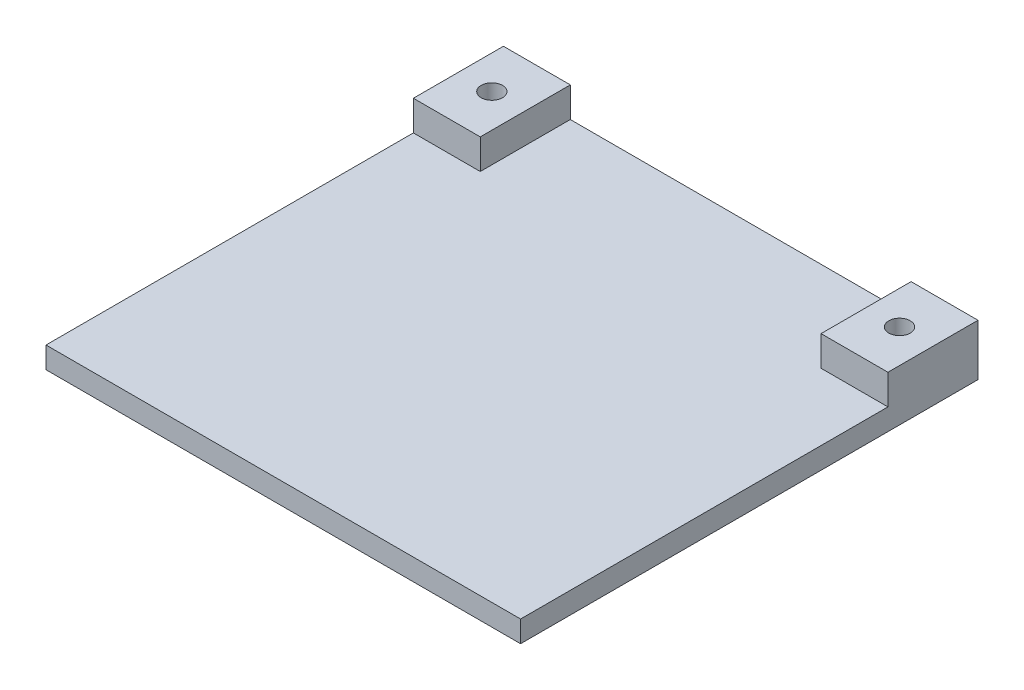
ISO-10303-21;
HEADER;
FILE_DESCRIPTION(('STEP AP214'),'2;1');
FILE_NAME('part.step','',(''),(''),'','','');
FILE_SCHEMA(('AUTOMOTIVE_DESIGN { 1 0 10303 214 1 1 1 1 }'));
ENDSEC;
DATA;
#1=APPLICATION_CONTEXT('core data for automotive mechanical design processes');
#2=APPLICATION_PROTOCOL_DEFINITION('international standard','automotive_design',2000,#1);
#3=PRODUCT_CONTEXT('',#1,'mechanical');
#4=PRODUCT('Part','Part','',(#3));
#5=PRODUCT_RELATED_PRODUCT_CATEGORY('part','',(#4));
#6=PRODUCT_DEFINITION_FORMATION('','',#4);
#7=PRODUCT_DEFINITION_CONTEXT('part definition',#1,'design');
#8=PRODUCT_DEFINITION('design','',#6,#7);
#9=PRODUCT_DEFINITION_SHAPE('','',#8);
#10=(LENGTH_UNIT() NAMED_UNIT(*) SI_UNIT(.MILLI.,.METRE.));
#11=(NAMED_UNIT(*) PLANE_ANGLE_UNIT() SI_UNIT($,.RADIAN.));
#12=(NAMED_UNIT(*) SI_UNIT($,.STERADIAN.) SOLID_ANGLE_UNIT());
#13=UNCERTAINTY_MEASURE_WITH_UNIT(LENGTH_MEASURE(1.E-05),#10,'distance_accuracy_value','');
#14=(GEOMETRIC_REPRESENTATION_CONTEXT(3) GLOBAL_UNCERTAINTY_ASSIGNED_CONTEXT((#13)) GLOBAL_UNIT_ASSIGNED_CONTEXT((#10,
#11,#12)) REPRESENTATION_CONTEXT('',''));
#15=CARTESIAN_POINT('',(0.,0.,0.));
#16=DIRECTION('',(0.,0.,1.));
#17=DIRECTION('',(1.,0.,0.));
#18=AXIS2_PLACEMENT_3D('',#15,#16,#17);
#19=CARTESIAN_POINT('',(0.,1.27,0.));
#20=DIRECTION('',(0.,1.,0.));
#21=DIRECTION('',(0.,0.,1.));
#22=AXIS2_PLACEMENT_3D('',#19,#20,#21);
#23=PLANE('',#22);
#24=DIRECTION('',(1.,0.,0.));
#25=VECTOR('',#24,1.);
#26=CARTESIAN_POINT('',(0.,1.27,-12.319));
#27=LINE('',#26,#25);
#28=CARTESIAN_POINT('',(15.1384,1.27,-12.319));
#29=VERTEX_POINT('',#28);
#30=CARTESIAN_POINT('',(21.082,1.27,-12.319));
#31=VERTEX_POINT('',#30);
#32=EDGE_CURVE('E47',#29,#31,#27,.T.);
#33=ORIENTED_EDGE('',*,*,#32,.F.);
#34=DIRECTION('',(0.,0.,-1.));
#35=VECTOR('',#34,1.);
#36=CARTESIAN_POINT('',(15.1384,1.27,0.));
#37=LINE('',#36,#35);
#38=CARTESIAN_POINT('',(15.1384,1.27,-20.32));
#39=VERTEX_POINT('',#38);
#40=EDGE_CURVE('E11',#29,#39,#37,.T.);
#41=ORIENTED_EDGE('',*,*,#40,.T.);
#42=DIRECTION('',(-1.,0.,0.));
#43=VECTOR('',#42,1.);
#44=CARTESIAN_POINT('',(0.,1.27,-20.32));
#45=LINE('',#44,#43);
#46=CARTESIAN_POINT('',(-15.1384,1.27,-20.32));
#47=VERTEX_POINT('',#46);
#48=EDGE_CURVE('E138',#39,#47,#45,.T.);
#49=ORIENTED_EDGE('',*,*,#48,.T.);
#50=DIRECTION('',(0.,0.,-1.));
#51=VECTOR('',#50,1.);
#52=CARTESIAN_POINT('',(-15.1384,1.27,0.));
#53=LINE('',#52,#51);
#54=CARTESIAN_POINT('',(-15.1384,1.27,-12.319));
#55=VERTEX_POINT('',#54);
#56=EDGE_CURVE('E198',#55,#47,#53,.T.);
#57=ORIENTED_EDGE('',*,*,#56,.F.);
#58=DIRECTION('',(-1.,0.,0.));
#59=VECTOR('',#58,1.);
#60=CARTESIAN_POINT('',(0.,1.27,-12.319));
#61=LINE('',#60,#59);
#62=CARTESIAN_POINT('',(-21.082,1.27,-12.319));
#63=VERTEX_POINT('',#62);
#64=EDGE_CURVE('E189',#55,#63,#61,.T.);
#65=ORIENTED_EDGE('',*,*,#64,.T.);
#66=DIRECTION('',(0.,0.,1.));
#67=VECTOR('',#66,1.);
#68=CARTESIAN_POINT('',(-21.082,1.27,0.));
#69=LINE('',#68,#67);
#70=CARTESIAN_POINT('',(-21.082,1.27,20.32));
#71=VERTEX_POINT('',#70);
#72=EDGE_CURVE('E163',#63,#71,#69,.T.);
#73=ORIENTED_EDGE('',*,*,#72,.T.);
#74=DIRECTION('',(-1.,0.,0.));
#75=VECTOR('',#74,1.);
#76=CARTESIAN_POINT('',(0.,1.27,20.32));
#77=LINE('',#76,#75);
#78=CARTESIAN_POINT('',(21.082,1.27,20.32));
#79=VERTEX_POINT('',#78);
#80=EDGE_CURVE('E165',#79,#71,#77,.T.);
#81=ORIENTED_EDGE('',*,*,#80,.F.);
#82=DIRECTION('',(0.,0.,1.));
#83=VECTOR('',#82,1.);
#84=CARTESIAN_POINT('',(21.082,1.27,0.));
#85=LINE('',#84,#83);
#86=EDGE_CURVE('E168',#31,#79,#85,.T.);
#87=ORIENTED_EDGE('',*,*,#86,.F.);
#88=EDGE_LOOP('',(#33,#41,#49,#57,#65,#73,#81,#87));
#89=FACE_BOUND('',#88,.T.);
#90=ADVANCED_FACE('F39',(#89),#23,.T.);
#91=CARTESIAN_POINT('',(0.,-0.635,-20.32));
#92=DIRECTION('',(0.,0.,-1.));
#93=DIRECTION('',(-1.,0.,0.));
#94=AXIS2_PLACEMENT_3D('',#91,#92,#93);
#95=PLANE('',#94);
#96=ORIENTED_EDGE('',*,*,#48,.F.);
#97=DIRECTION('',(0.,-1.,0.));
#98=VECTOR('',#97,1.);
#99=CARTESIAN_POINT('',(15.1384,3.937,-20.32));
#100=LINE('',#99,#98);
#101=CARTESIAN_POINT('',(15.1384,3.937,-20.32));
#102=VERTEX_POINT('',#101);
#103=EDGE_CURVE('E120',#102,#39,#100,.T.);
#104=ORIENTED_EDGE('',*,*,#103,.F.);
#105=DIRECTION('',(-1.,0.,0.));
#106=VECTOR('',#105,1.);
#107=CARTESIAN_POINT('',(0.,3.937,-20.32));
#108=LINE('',#107,#106);
#109=CARTESIAN_POINT('',(21.082,3.937,-20.32));
#110=VERTEX_POINT('',#109);
#111=EDGE_CURVE('E127',#110,#102,#108,.T.);
#112=ORIENTED_EDGE('',*,*,#111,.F.);
#113=DIRECTION('',(0.,1.,0.));
#114=VECTOR('',#113,1.);
#115=CARTESIAN_POINT('',(21.082,-0.635,-20.32));
#116=LINE('',#115,#114);
#117=CARTESIAN_POINT('',(21.082,-0.635,-20.32));
#118=VERTEX_POINT('',#117);
#119=EDGE_CURVE('E187',#118,#110,#116,.T.);
#120=ORIENTED_EDGE('',*,*,#119,.F.);
#121=DIRECTION('',(-1.,0.,0.));
#122=VECTOR('',#121,1.);
#123=CARTESIAN_POINT('',(0.,-0.635,-20.32));
#124=LINE('',#123,#122);
#125=CARTESIAN_POINT('',(-21.082,-0.635,-20.32));
#126=VERTEX_POINT('',#125);
#127=EDGE_CURVE('E170',#118,#126,#124,.T.);
#128=ORIENTED_EDGE('',*,*,#127,.T.);
#129=DIRECTION('',(0.,1.,0.));
#130=VECTOR('',#129,1.);
#131=CARTESIAN_POINT('',(-21.082,-0.635,-20.32));
#132=LINE('',#131,#130);
#133=CARTESIAN_POINT('',(-21.082,3.937,-20.32));
#134=VERTEX_POINT('',#133);
#135=EDGE_CURVE('E186',#126,#134,#132,.T.);
#136=ORIENTED_EDGE('',*,*,#135,.T.);
#137=DIRECTION('',(-1.,0.,0.));
#138=VECTOR('',#137,1.);
#139=CARTESIAN_POINT('',(0.,3.937,-20.32));
#140=LINE('',#139,#138);
#141=CARTESIAN_POINT('',(-15.1384,3.937,-20.32));
#142=VERTEX_POINT('',#141);
#143=EDGE_CURVE('E142',#142,#134,#140,.T.);
#144=ORIENTED_EDGE('',*,*,#143,.F.);
#145=DIRECTION('',(0.,-1.,0.));
#146=VECTOR('',#145,1.);
#147=CARTESIAN_POINT('',(-15.1384,3.937,-20.32));
#148=LINE('',#147,#146);
#149=EDGE_CURVE('E160',#142,#47,#148,.T.);
#150=ORIENTED_EDGE('',*,*,#149,.T.);
#151=EDGE_LOOP('',(#96,#104,#112,#120,#128,#136,#144,#150));
#152=FACE_BOUND('',#151,.T.);
#153=ADVANCED_FACE('F41',(#152),#95,.T.);
#154=CARTESIAN_POINT('',(21.082,-0.635,0.));
#155=DIRECTION('',(-1.,0.,0.));
#156=DIRECTION('',(0.,0.,1.));
#157=AXIS2_PLACEMENT_3D('',#154,#155,#156);
#158=PLANE('',#157);
#159=DIRECTION('',(0.,-1.,0.));
#160=VECTOR('',#159,1.);
#161=CARTESIAN_POINT('',(21.082,3.937,-12.319));
#162=LINE('',#161,#160);
#163=CARTESIAN_POINT('',(21.082,3.937,-12.319));
#164=VERTEX_POINT('',#163);
#165=EDGE_CURVE('E54',#164,#31,#162,.T.);
#166=ORIENTED_EDGE('',*,*,#165,.T.);
#167=ORIENTED_EDGE('',*,*,#86,.T.);
#168=DIRECTION('',(0.,1.,0.));
#169=VECTOR('',#168,1.);
#170=CARTESIAN_POINT('',(21.082,-0.635,20.32));
#171=LINE('',#170,#169);
#172=CARTESIAN_POINT('',(21.082,-0.635,20.32));
#173=VERTEX_POINT('',#172);
#174=EDGE_CURVE('E190',#173,#79,#171,.T.);
#175=ORIENTED_EDGE('',*,*,#174,.F.);
#176=DIRECTION('',(0.,0.,1.));
#177=VECTOR('',#176,1.);
#178=CARTESIAN_POINT('',(21.082,-0.635,0.));
#179=LINE('',#178,#177);
#180=EDGE_CURVE('E178',#118,#173,#179,.T.);
#181=ORIENTED_EDGE('',*,*,#180,.F.);
#182=ORIENTED_EDGE('',*,*,#119,.T.);
#183=DIRECTION('',(0.,0.,1.));
#184=VECTOR('',#183,1.);
#185=CARTESIAN_POINT('',(21.082,3.937,0.));
#186=LINE('',#185,#184);
#187=EDGE_CURVE('E132',#110,#164,#186,.T.);
#188=ORIENTED_EDGE('',*,*,#187,.T.);
#189=EDGE_LOOP('',(#166,#167,#175,#181,#182,#188));
#190=FACE_BOUND('',#189,.T.);
#191=ADVANCED_FACE('F207',(#190),#158,.F.);
#192=CARTESIAN_POINT('',(0.,-0.635,20.32));
#193=DIRECTION('',(0.,0.,-1.));
#194=DIRECTION('',(-1.,0.,0.));
#195=AXIS2_PLACEMENT_3D('',#192,#193,#194);
#196=PLANE('',#195);
#197=ORIENTED_EDGE('',*,*,#174,.T.);
#198=ORIENTED_EDGE('',*,*,#80,.T.);
#199=DIRECTION('',(0.,1.,0.));
#200=VECTOR('',#199,1.);
#201=CARTESIAN_POINT('',(-21.082,-0.635,20.32));
#202=LINE('',#201,#200);
#203=CARTESIAN_POINT('',(-21.082,-0.635,20.32));
#204=VERTEX_POINT('',#203);
#205=EDGE_CURVE('E193',#204,#71,#202,.T.);
#206=ORIENTED_EDGE('',*,*,#205,.F.);
#207=DIRECTION('',(-1.,0.,0.));
#208=VECTOR('',#207,1.);
#209=CARTESIAN_POINT('',(0.,-0.635,20.32));
#210=LINE('',#209,#208);
#211=EDGE_CURVE('E176',#173,#204,#210,.T.);
#212=ORIENTED_EDGE('',*,*,#211,.F.);
#213=EDGE_LOOP('',(#197,#198,#206,#212));
#214=FACE_BOUND('',#213,.T.);
#215=ADVANCED_FACE('F211',(#214),#196,.F.);
#216=CARTESIAN_POINT('',(18.1102,-0.635,-16.3195));
#217=DIRECTION('',(0.,1.,0.));
#218=DIRECTION('',(0.,0.,1.));
#219=AXIS2_PLACEMENT_3D('',#216,#217,#218);
#220=CYLINDRICAL_SURFACE('',#219,0.9525);
#221=CARTESIAN_POINT('',(18.1102,3.937,-16.3195));
#222=DIRECTION('',(0.,1.,0.));
#223=DIRECTION('',(0.,0.,1.));
#224=AXIS2_PLACEMENT_3D('',#221,#222,#223);
#225=CIRCLE('',#224,0.9525);
#226=CARTESIAN_POINT('',(18.1102,3.937,-15.367));
#227=VERTEX_POINT('',#226);
#228=EDGE_CURVE('E134',#227,#227,#225,.T.);
#229=ORIENTED_EDGE('',*,*,#228,.T.);
#230=EDGE_LOOP('',(#229));
#231=FACE_BOUND('',#230,.T.);
#232=CARTESIAN_POINT('',(18.1102,-0.635,-16.3195));
#233=DIRECTION('',(0.,1.,0.));
#234=DIRECTION('',(0.,0.,1.));
#235=AXIS2_PLACEMENT_3D('',#232,#233,#234);
#236=CIRCLE('',#235,0.9525);
#237=CARTESIAN_POINT('',(18.1102,-0.635,-15.367));
#238=VERTEX_POINT('',#237);
#239=EDGE_CURVE('E180',#238,#238,#236,.T.);
#240=ORIENTED_EDGE('',*,*,#239,.F.);
#241=EDGE_LOOP('',(#240));
#242=FACE_BOUND('',#241,.T.);
#243=ADVANCED_FACE('F250',(#231,#242),#220,.F.);
#244=CARTESIAN_POINT('',(-21.082,-0.635,0.));
#245=DIRECTION('',(-1.,0.,0.));
#246=DIRECTION('',(0.,0.,1.));
#247=AXIS2_PLACEMENT_3D('',#244,#245,#246);
#248=PLANE('',#247);
#249=ORIENTED_EDGE('',*,*,#72,.F.);
#250=DIRECTION('',(0.,-1.,0.));
#251=VECTOR('',#250,1.);
#252=CARTESIAN_POINT('',(-21.082,3.937,-12.319));
#253=LINE('',#252,#251);
#254=CARTESIAN_POINT('',(-21.082,3.937,-12.319));
#255=VERTEX_POINT('',#254);
#256=EDGE_CURVE('E62',#255,#63,#253,.T.);
#257=ORIENTED_EDGE('',*,*,#256,.F.);
#258=DIRECTION('',(0.,0.,1.));
#259=VECTOR('',#258,1.);
#260=CARTESIAN_POINT('',(-21.082,3.937,0.));
#261=LINE('',#260,#259);
#262=EDGE_CURVE('E149',#134,#255,#261,.T.);
#263=ORIENTED_EDGE('',*,*,#262,.F.);
#264=ORIENTED_EDGE('',*,*,#135,.F.);
#265=DIRECTION('',(0.,0.,1.));
#266=VECTOR('',#265,1.);
#267=CARTESIAN_POINT('',(-21.082,-0.635,0.));
#268=LINE('',#267,#266);
#269=EDGE_CURVE('E173',#126,#204,#268,.T.);
#270=ORIENTED_EDGE('',*,*,#269,.T.);
#271=ORIENTED_EDGE('',*,*,#205,.T.);
#272=EDGE_LOOP('',(#249,#257,#263,#264,#270,#271));
#273=FACE_BOUND('',#272,.T.);
#274=ADVANCED_FACE('F226',(#273),#248,.T.);
#275=CARTESIAN_POINT('',(-18.1102,-0.635,-16.3195));
#276=DIRECTION('',(0.,1.,0.));
#277=DIRECTION('',(0.,0.,1.));
#278=AXIS2_PLACEMENT_3D('',#275,#276,#277);
#279=CYLINDRICAL_SURFACE('',#278,0.9525);
#280=CARTESIAN_POINT('',(-18.1102,3.937,-16.3195));
#281=DIRECTION('',(0.,1.,0.));
#282=DIRECTION('',(0.,0.,1.));
#283=AXIS2_PLACEMENT_3D('',#280,#281,#282);
#284=CIRCLE('',#283,0.9525);
#285=CARTESIAN_POINT('',(-18.1102,3.937,-15.367));
#286=VERTEX_POINT('',#285);
#287=EDGE_CURVE('E153',#286,#286,#284,.F.);
#288=ORIENTED_EDGE('',*,*,#287,.F.);
#289=EDGE_LOOP('',(#288));
#290=FACE_BOUND('',#289,.T.);
#291=CARTESIAN_POINT('',(-18.1102,-0.635,-16.3195));
#292=DIRECTION('',(0.,1.,0.));
#293=DIRECTION('',(0.,0.,1.));
#294=AXIS2_PLACEMENT_3D('',#291,#292,#293);
#295=CIRCLE('',#294,0.9525);
#296=CARTESIAN_POINT('',(-18.1102,-0.635,-15.367));
#297=VERTEX_POINT('',#296);
#298=EDGE_CURVE('E183',#297,#297,#295,.F.);
#299=ORIENTED_EDGE('',*,*,#298,.T.);
#300=EDGE_LOOP('',(#299));
#301=FACE_BOUND('',#300,.T.);
#302=ADVANCED_FACE('F239',(#290,#301),#279,.F.);
#303=CARTESIAN_POINT('',(0.,-0.635,0.));
#304=DIRECTION('',(0.,1.,0.));
#305=DIRECTION('',(0.,0.,1.));
#306=AXIS2_PLACEMENT_3D('',#303,#304,#305);
#307=PLANE('',#306);
#308=ORIENTED_EDGE('',*,*,#127,.F.);
#309=ORIENTED_EDGE('',*,*,#180,.T.);
#310=ORIENTED_EDGE('',*,*,#211,.T.);
#311=ORIENTED_EDGE('',*,*,#269,.F.);
#312=EDGE_LOOP('',(#308,#309,#310,#311));
#313=FACE_BOUND('',#312,.T.);
#314=ORIENTED_EDGE('',*,*,#239,.T.);
#315=EDGE_LOOP('',(#314));
#316=FACE_BOUND('',#315,.T.);
#317=ORIENTED_EDGE('',*,*,#298,.F.);
#318=EDGE_LOOP('',(#317));
#319=FACE_BOUND('',#318,.T.);
#320=ADVANCED_FACE('F216',(#313,#316,#319),#307,.F.);
#321=CARTESIAN_POINT('',(-15.1384,3.937,0.));
#322=DIRECTION('',(1.,0.,0.));
#323=DIRECTION('',(0.,0.,-1.));
#324=AXIS2_PLACEMENT_3D('',#321,#322,#323);
#325=PLANE('',#324);
#326=DIRECTION('',(0.,-1.,0.));
#327=VECTOR('',#326,1.);
#328=CARTESIAN_POINT('',(-15.1384,3.937,-12.319));
#329=LINE('',#328,#327);
#330=CARTESIAN_POINT('',(-15.1384,3.937,-12.319));
#331=VERTEX_POINT('',#330);
#332=EDGE_CURVE('E156',#331,#55,#329,.T.);
#333=ORIENTED_EDGE('',*,*,#332,.T.);
#334=ORIENTED_EDGE('',*,*,#56,.T.);
#335=ORIENTED_EDGE('',*,*,#149,.F.);
#336=DIRECTION('',(0.,0.,1.));
#337=VECTOR('',#336,1.);
#338=CARTESIAN_POINT('',(-15.1384,3.937,0.));
#339=LINE('',#338,#337);
#340=EDGE_CURVE('E139',#142,#331,#339,.T.);
#341=ORIENTED_EDGE('',*,*,#340,.T.);
#342=EDGE_LOOP('',(#333,#334,#335,#341));
#343=FACE_BOUND('',#342,.T.);
#344=ADVANCED_FACE('F231',(#343),#325,.T.);
#345=CARTESIAN_POINT('',(0.,3.937,-12.319));
#346=DIRECTION('',(0.,0.,-1.));
#347=DIRECTION('',(-1.,0.,0.));
#348=AXIS2_PLACEMENT_3D('',#345,#346,#347);
#349=PLANE('',#348);
#350=ORIENTED_EDGE('',*,*,#64,.F.);
#351=ORIENTED_EDGE('',*,*,#332,.F.);
#352=DIRECTION('',(1.,0.,0.));
#353=VECTOR('',#352,1.);
#354=CARTESIAN_POINT('',(0.,3.937,-12.319));
#355=LINE('',#354,#353);
#356=EDGE_CURVE('E151',#255,#331,#355,.T.);
#357=ORIENTED_EDGE('',*,*,#356,.F.);
#358=ORIENTED_EDGE('',*,*,#256,.T.);
#359=EDGE_LOOP('',(#350,#351,#357,#358));
#360=FACE_BOUND('',#359,.T.);
#361=ADVANCED_FACE('F228',(#360),#349,.F.);
#362=CARTESIAN_POINT('',(0.,3.937,0.));
#363=DIRECTION('',(0.,1.,0.));
#364=DIRECTION('',(0.,0.,1.));
#365=AXIS2_PLACEMENT_3D('',#362,#363,#364);
#366=PLANE('',#365);
#367=ORIENTED_EDGE('',*,*,#340,.F.);
#368=ORIENTED_EDGE('',*,*,#143,.T.);
#369=ORIENTED_EDGE('',*,*,#262,.T.);
#370=ORIENTED_EDGE('',*,*,#356,.T.);
#371=EDGE_LOOP('',(#367,#368,#369,#370));
#372=FACE_BOUND('',#371,.T.);
#373=ORIENTED_EDGE('',*,*,#287,.T.);
#374=EDGE_LOOP('',(#373));
#375=FACE_BOUND('',#374,.T.);
#376=ADVANCED_FACE('F223',(#372,#375),#366,.T.);
#377=CARTESIAN_POINT('',(15.1384,3.937,0.));
#378=DIRECTION('',(1.,0.,0.));
#379=DIRECTION('',(0.,0.,-1.));
#380=AXIS2_PLACEMENT_3D('',#377,#378,#379);
#381=PLANE('',#380);
#382=ORIENTED_EDGE('',*,*,#40,.F.);
#383=DIRECTION('',(0.,-1.,0.));
#384=VECTOR('',#383,1.);
#385=CARTESIAN_POINT('',(15.1384,3.937,-12.319));
#386=LINE('',#385,#384);
#387=CARTESIAN_POINT('',(15.1384,3.937,-12.319));
#388=VERTEX_POINT('',#387);
#389=EDGE_CURVE('E122',#388,#29,#386,.T.);
#390=ORIENTED_EDGE('',*,*,#389,.F.);
#391=DIRECTION('',(0.,0.,1.));
#392=VECTOR('',#391,1.);
#393=CARTESIAN_POINT('',(15.1384,3.937,0.));
#394=LINE('',#393,#392);
#395=EDGE_CURVE('E116',#102,#388,#394,.T.);
#396=ORIENTED_EDGE('',*,*,#395,.F.);
#397=ORIENTED_EDGE('',*,*,#103,.T.);
#398=EDGE_LOOP('',(#382,#390,#396,#397));
#399=FACE_BOUND('',#398,.T.);
#400=ADVANCED_FACE('F118',(#399),#381,.F.);
#401=CARTESIAN_POINT('',(0.,3.937,-12.319));
#402=DIRECTION('',(0.,0.,1.));
#403=DIRECTION('',(1.,0.,0.));
#404=AXIS2_PLACEMENT_3D('',#401,#402,#403);
#405=PLANE('',#404);
#406=ORIENTED_EDGE('',*,*,#389,.T.);
#407=ORIENTED_EDGE('',*,*,#32,.T.);
#408=ORIENTED_EDGE('',*,*,#165,.F.);
#409=DIRECTION('',(-1.,0.,0.));
#410=VECTOR('',#409,1.);
#411=CARTESIAN_POINT('',(0.,3.937,-12.319));
#412=LINE('',#411,#410);
#413=EDGE_CURVE('E126',#164,#388,#412,.T.);
#414=ORIENTED_EDGE('',*,*,#413,.T.);
#415=EDGE_LOOP('',(#406,#407,#408,#414));
#416=FACE_BOUND('',#415,.T.);
#417=ADVANCED_FACE('F203',(#416),#405,.T.);
#418=CARTESIAN_POINT('',(0.,3.937,0.));
#419=DIRECTION('',(0.,1.,0.));
#420=DIRECTION('',(0.,0.,1.));
#421=AXIS2_PLACEMENT_3D('',#418,#419,#420);
#422=PLANE('',#421);
#423=ORIENTED_EDGE('',*,*,#228,.F.);
#424=EDGE_LOOP('',(#423));
#425=FACE_BOUND('',#424,.T.);
#426=ORIENTED_EDGE('',*,*,#111,.T.);
#427=ORIENTED_EDGE('',*,*,#395,.T.);
#428=ORIENTED_EDGE('',*,*,#413,.F.);
#429=ORIENTED_EDGE('',*,*,#187,.F.);
#430=EDGE_LOOP('',(#426,#427,#428,#429));
#431=FACE_BOUND('',#430,.T.);
#432=ADVANCED_FACE('F131',(#425,#431),#422,.T.);
#433=CLOSED_SHELL('',(#90,#153,#191,#215,#243,#274,#302,#320,#344,#361,#376,#400,#417,#432));
#434=MANIFOLD_SOLID_BREP('B2',#433);
#435=ADVANCED_BREP_SHAPE_REPRESENTATION('',(#18,#434),#14);
#436=SHAPE_DEFINITION_REPRESENTATION(#9,#435);
ENDSEC;
END-ISO-10303-21;
